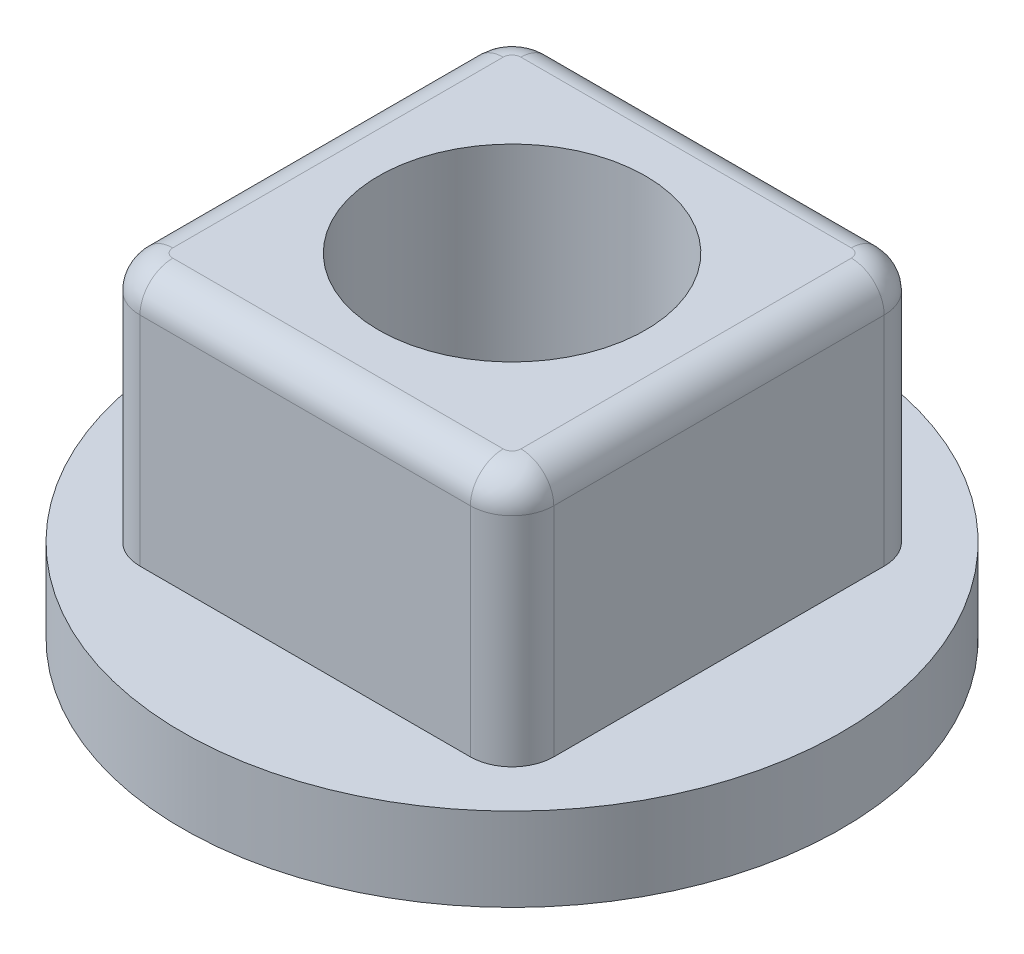
ISO-10303-21;
HEADER;
FILE_DESCRIPTION(('STEP AP214'),'2;1');
FILE_NAME('part.step','',(''),(''),'','','');
FILE_SCHEMA(('AUTOMOTIVE_DESIGN { 1 0 10303 214 1 1 1 1 }'));
ENDSEC;
DATA;
#1=APPLICATION_CONTEXT('core data for automotive mechanical design processes');
#2=APPLICATION_PROTOCOL_DEFINITION('international standard','automotive_design',2000,#1);
#3=PRODUCT_CONTEXT('',#1,'mechanical');
#4=PRODUCT('Part','Part','',(#3));
#5=PRODUCT_RELATED_PRODUCT_CATEGORY('part','',(#4));
#6=PRODUCT_DEFINITION_FORMATION('','',#4);
#7=PRODUCT_DEFINITION_CONTEXT('part definition',#1,'design');
#8=PRODUCT_DEFINITION('design','',#6,#7);
#9=PRODUCT_DEFINITION_SHAPE('','',#8);
#10=(LENGTH_UNIT() NAMED_UNIT(*) SI_UNIT(.MILLI.,.METRE.));
#11=(NAMED_UNIT(*) PLANE_ANGLE_UNIT() SI_UNIT($,.RADIAN.));
#12=(NAMED_UNIT(*) SI_UNIT($,.STERADIAN.) SOLID_ANGLE_UNIT());
#13=UNCERTAINTY_MEASURE_WITH_UNIT(LENGTH_MEASURE(1.E-05),#10,'distance_accuracy_value','');
#14=(GEOMETRIC_REPRESENTATION_CONTEXT(3) GLOBAL_UNCERTAINTY_ASSIGNED_CONTEXT((#13)) GLOBAL_UNIT_ASSIGNED_CONTEXT((#10,
#11,#12)) REPRESENTATION_CONTEXT('',''));
#15=CARTESIAN_POINT('',(0.,0.,0.));
#16=DIRECTION('',(0.,0.,1.));
#17=DIRECTION('',(1.,0.,0.));
#18=AXIS2_PLACEMENT_3D('',#15,#16,#17);
#19=CARTESIAN_POINT('',(-2.5146,5.08,2.5146));
#20=DIRECTION('',(0.,-1.,0.));
#21=DIRECTION('',(0.,0.,-1.));
#22=AXIS2_PLACEMENT_3D('',#19,#20,#21);
#23=CYLINDRICAL_SURFACE('',#22,0.635);
#24=DIRECTION('',(0.,1.,0.));
#25=VECTOR('',#24,1.);
#26=CARTESIAN_POINT('',(-3.1496,5.08,2.51459999999995));
#27=LINE('',#26,#25);
#28=CARTESIAN_POINT('',(-3.14960000000036,4.58,2.51460000000302));
#29=VERTEX_POINT('',#28);
#30=CARTESIAN_POINT('',(-3.1496,1.27,2.51459999999997));
#31=VERTEX_POINT('',#30);
#32=EDGE_CURVE('E69',#29,#31,#27,.F.);
#33=ORIENTED_EDGE('',*,*,#32,.T.);
#34=CARTESIAN_POINT('',(-2.5146,1.27,2.5146));
#35=DIRECTION('',(0.,-1.,0.));
#36=DIRECTION('',(0.,0.,-1.));
#37=AXIS2_PLACEMENT_3D('',#34,#35,#36);
#38=CIRCLE('',#37,0.635);
#39=CARTESIAN_POINT('',(-2.5146,1.27,3.1496));
#40=VERTEX_POINT('',#39);
#41=EDGE_CURVE('E21',#31,#40,#38,.F.);
#42=ORIENTED_EDGE('',*,*,#41,.T.);
#43=DIRECTION('',(0.,1.,0.));
#44=VECTOR('',#43,1.);
#45=CARTESIAN_POINT('',(-2.5146,5.08,3.1496));
#46=LINE('',#45,#44);
#47=CARTESIAN_POINT('',(-2.5146,4.58,3.14959999999967));
#48=VERTEX_POINT('',#47);
#49=EDGE_CURVE('E66',#40,#48,#46,.T.);
#50=ORIENTED_EDGE('',*,*,#49,.T.);
#51=CARTESIAN_POINT('',(-2.51460000000003,4.58000000000001,2.51459999999865));
#52=DIRECTION('',(0.,-1.,0.));
#53=DIRECTION('',(0.,0.,-1.));
#54=AXIS2_PLACEMENT_3D('',#51,#52,#53);
#55=CIRCLE('',#54,0.635000000000685);
#56=EDGE_CURVE('E232',#29,#48,#55,.F.);
#57=ORIENTED_EDGE('',*,*,#56,.F.);
#58=EDGE_LOOP('',(#33,#42,#50,#57));
#59=FACE_BOUND('',#58,.T.);
#60=ADVANCED_FACE('F18',(#59),#23,.T.);
#61=CARTESIAN_POINT('',(-2.5146,5.08,-2.5146));
#62=DIRECTION('',(0.,-1.,0.));
#63=DIRECTION('',(0.,0.,-1.));
#64=AXIS2_PLACEMENT_3D('',#61,#62,#63);
#65=CYLINDRICAL_SURFACE('',#64,0.635);
#66=DIRECTION('',(0.,1.,0.));
#67=VECTOR('',#66,1.);
#68=CARTESIAN_POINT('',(-2.51459999999995,5.08,-3.1496));
#69=LINE('',#68,#67);
#70=CARTESIAN_POINT('',(-2.51460000000237,4.58000000000076,-3.1496));
#71=VERTEX_POINT('',#70);
#72=CARTESIAN_POINT('',(-2.51459999999997,1.27,-3.1496));
#73=VERTEX_POINT('',#72);
#74=EDGE_CURVE('E188',#71,#73,#69,.F.);
#75=ORIENTED_EDGE('',*,*,#74,.T.);
#76=CARTESIAN_POINT('',(-2.5146,1.27,-2.5146));
#77=DIRECTION('',(0.,-1.,0.));
#78=DIRECTION('',(0.,0.,-1.));
#79=AXIS2_PLACEMENT_3D('',#76,#77,#78);
#80=CIRCLE('',#79,0.635);
#81=CARTESIAN_POINT('',(-3.1496,1.27,-2.5146));
#82=VERTEX_POINT('',#81);
#83=EDGE_CURVE('E71',#73,#82,#80,.F.);
#84=ORIENTED_EDGE('',*,*,#83,.T.);
#85=DIRECTION('',(0.,1.,0.));
#86=VECTOR('',#85,1.);
#87=CARTESIAN_POINT('',(-3.1496,5.08,-2.5146));
#88=LINE('',#87,#86);
#89=CARTESIAN_POINT('',(-3.14959999999983,4.58,-2.5146));
#90=VERTEX_POINT('',#89);
#91=EDGE_CURVE('E201',#82,#90,#88,.T.);
#92=ORIENTED_EDGE('',*,*,#91,.T.);
#93=CARTESIAN_POINT('',(-2.51459999999865,4.58000000000001,-2.51460000000003));
#94=DIRECTION('',(0.,-1.,0.));
#95=DIRECTION('',(1.,0.,0.));
#96=AXIS2_PLACEMENT_3D('',#93,#94,#95);
#97=CIRCLE('',#96,0.635000000000685);
#98=EDGE_CURVE('E242',#71,#90,#97,.F.);
#99=ORIENTED_EDGE('',*,*,#98,.F.);
#100=EDGE_LOOP('',(#75,#84,#92,#99));
#101=FACE_BOUND('',#100,.T.);
#102=ADVANCED_FACE('F369',(#101),#65,.T.);
#103=CARTESIAN_POINT('',(2.5146,5.08,2.5146));
#104=DIRECTION('',(0.,-1.,0.));
#105=DIRECTION('',(0.,0.,-1.));
#106=AXIS2_PLACEMENT_3D('',#103,#104,#105);
#107=CYLINDRICAL_SURFACE('',#106,0.635);
#108=DIRECTION('',(0.,1.,0.));
#109=VECTOR('',#108,1.);
#110=CARTESIAN_POINT('',(2.51459999999995,5.08,3.1496));
#111=LINE('',#110,#109);
#112=CARTESIAN_POINT('',(2.51460000000302,4.58,3.14960000000036));
#113=VERTEX_POINT('',#112);
#114=CARTESIAN_POINT('',(2.51459999999997,1.27,3.1496));
#115=VERTEX_POINT('',#114);
#116=EDGE_CURVE('E204',#113,#115,#111,.F.);
#117=ORIENTED_EDGE('',*,*,#116,.T.);
#118=CARTESIAN_POINT('',(2.5146,1.27,2.5146));
#119=DIRECTION('',(0.,-1.,0.));
#120=DIRECTION('',(0.,0.,-1.));
#121=AXIS2_PLACEMENT_3D('',#118,#119,#120);
#122=CIRCLE('',#121,0.635);
#123=CARTESIAN_POINT('',(3.1496,1.27,2.5146));
#124=VERTEX_POINT('',#123);
#125=EDGE_CURVE('E83',#115,#124,#122,.F.);
#126=ORIENTED_EDGE('',*,*,#125,.T.);
#127=DIRECTION('',(0.,1.,0.));
#128=VECTOR('',#127,1.);
#129=CARTESIAN_POINT('',(3.1496,5.08,2.5146));
#130=LINE('',#129,#128);
#131=CARTESIAN_POINT('',(3.14959999999983,4.58,2.51460000000015));
#132=VERTEX_POINT('',#131);
#133=EDGE_CURVE('E185',#124,#132,#130,.T.);
#134=ORIENTED_EDGE('',*,*,#133,.T.);
#135=CARTESIAN_POINT('',(2.51459999999865,4.58000000000001,2.51460000000003));
#136=DIRECTION('',(0.,-1.,0.));
#137=DIRECTION('',(1.,0.,0.));
#138=AXIS2_PLACEMENT_3D('',#135,#136,#137);
#139=CIRCLE('',#138,0.635000000000685);
#140=EDGE_CURVE('E301',#113,#132,#139,.F.);
#141=ORIENTED_EDGE('',*,*,#140,.F.);
#142=EDGE_LOOP('',(#117,#126,#134,#141));
#143=FACE_BOUND('',#142,.T.);
#144=ADVANCED_FACE('F400',(#143),#107,.T.);
#145=CARTESIAN_POINT('',(2.5146,5.08,-2.5146));
#146=DIRECTION('',(0.,-1.,0.));
#147=DIRECTION('',(0.,0.,-1.));
#148=AXIS2_PLACEMENT_3D('',#145,#146,#147);
#149=CYLINDRICAL_SURFACE('',#148,0.635);
#150=DIRECTION('',(0.,1.,0.));
#151=VECTOR('',#150,1.);
#152=CARTESIAN_POINT('',(3.1496,5.08,-2.51459999999997));
#153=LINE('',#152,#151);
#154=CARTESIAN_POINT('',(3.14960000000036,4.58,-2.51460000000303));
#155=VERTEX_POINT('',#154);
#156=CARTESIAN_POINT('',(3.1496,1.27,-2.51459999999999));
#157=VERTEX_POINT('',#156);
#158=EDGE_CURVE('E172',#155,#157,#153,.F.);
#159=ORIENTED_EDGE('',*,*,#158,.T.);
#160=CARTESIAN_POINT('',(2.5146,1.27,-2.5146));
#161=DIRECTION('',(0.,-1.,0.));
#162=DIRECTION('',(0.,0.,-1.));
#163=AXIS2_PLACEMENT_3D('',#160,#161,#162);
#164=CIRCLE('',#163,0.635);
#165=CARTESIAN_POINT('',(2.5146,1.27,-3.1496));
#166=VERTEX_POINT('',#165);
#167=EDGE_CURVE('E36',#157,#166,#164,.F.);
#168=ORIENTED_EDGE('',*,*,#167,.T.);
#169=DIRECTION('',(0.,1.,0.));
#170=VECTOR('',#169,1.);
#171=CARTESIAN_POINT('',(2.5146,5.08,-3.1496));
#172=LINE('',#171,#170);
#173=CARTESIAN_POINT('',(2.51460000000001,4.58,-3.14959999999983));
#174=VERTEX_POINT('',#173);
#175=EDGE_CURVE('E191',#166,#174,#172,.T.);
#176=ORIENTED_EDGE('',*,*,#175,.T.);
#177=CARTESIAN_POINT('',(2.51460000000003,4.58000000000001,-2.51459999999865));
#178=DIRECTION('',(0.,-1.,0.));
#179=DIRECTION('',(0.,0.,-1.));
#180=AXIS2_PLACEMENT_3D('',#177,#178,#179);
#181=CIRCLE('',#180,0.635000000000685);
#182=EDGE_CURVE('E271',#155,#174,#181,.F.);
#183=ORIENTED_EDGE('',*,*,#182,.F.);
#184=EDGE_LOOP('',(#159,#168,#176,#183));
#185=FACE_BOUND('',#184,.T.);
#186=ADVANCED_FACE('F413',(#185),#149,.T.);
#187=CARTESIAN_POINT('',(2.538898108304,4.58,2.6496));
#188=DIRECTION('',(-1.,0.,0.));
#189=DIRECTION('',(0.,0.,1.));
#190=AXIS2_PLACEMENT_3D('',#187,#188,#189);
#191=CYLINDRICAL_SURFACE('',#190,0.5);
#192=CARTESIAN_POINT('',(2.51460000000023,4.58000000000151,2.64960000000213));
#193=DIRECTION('',(-1.,0.,1.17253486400112E-11));
#194=DIRECTION('',(1.17253486400112E-11,0.,1.));
#195=AXIS2_PLACEMENT_3D('',#192,#193,#194);
#196=CIRCLE('',#195,0.499999999998586);
#197=CARTESIAN_POINT('',(2.51460000000024,5.08000000000005,2.64959999798593));
#198=VERTEX_POINT('',#197);
#199=EDGE_CURVE('E171',#198,#113,#196,.F.);
#200=ORIENTED_EDGE('',*,*,#199,.F.);
#201=DIRECTION('',(1.,0.,0.));
#202=VECTOR('',#201,1.);
#203=CARTESIAN_POINT('',(-3.1496,5.08,2.6496));
#204=LINE('',#203,#202);
#205=CARTESIAN_POINT('',(-2.51460000000002,5.08000000000005,2.64960000000019));
#206=VERTEX_POINT('',#205);
#207=EDGE_CURVE('E158',#206,#198,#204,.T.);
#208=ORIENTED_EDGE('',*,*,#207,.F.);
#209=CARTESIAN_POINT('',(-2.51460000000002,4.58000000000152,2.64960000000074));
#210=DIRECTION('',(-1.,0.,0.));
#211=DIRECTION('',(0.,0.,1.));
#212=AXIS2_PLACEMENT_3D('',#209,#210,#211);
#213=CIRCLE('',#212,0.499999999998586);
#214=EDGE_CURVE('E80',#48,#206,#213,.T.);
#215=ORIENTED_EDGE('',*,*,#214,.F.);
#216=DIRECTION('',(-1.,0.,0.));
#217=VECTOR('',#216,1.);
#218=CARTESIAN_POINT('',(-3.1496,4.58,3.1496));
#219=LINE('',#218,#217);
#220=EDGE_CURVE('E78',#48,#113,#219,.F.);
#221=ORIENTED_EDGE('',*,*,#220,.T.);
#222=EDGE_LOOP('',(#200,#208,#215,#221));
#223=FACE_BOUND('',#222,.T.);
#224=ADVANCED_FACE('F169',(#223),#191,.T.);
#225=CARTESIAN_POINT('',(2.64960000000074,4.58000000000151,2.51460000000003));
#226=DIRECTION('',(0.,0.,1.));
#227=DIRECTION('',(1.,0.,0.));
#228=AXIS2_PLACEMENT_3D('',#225,#226,#227);
#229=CIRCLE('',#228,0.499999999998586);
#230=TRIMMED_CURVE('',#229,(PARAMETER_VALUE(-1.84418935826752)),
(PARAMETER_VALUE(1.84418935826752)),.T.,.PARAMETER.);
#231=CARTESIAN_POINT('',(2.51459999999865,4.58000000000152,2.51460000000003));
#232=DIRECTION('',(0.,-1.,0.));
#233=AXIS1_PLACEMENT('',#231,#232);
#234=SURFACE_OF_REVOLUTION('',#230,#233);
#235=CARTESIAN_POINT('',(2.6496,4.58,2.51460000000056));
#236=DIRECTION('',(0.,0.,1.));
#237=DIRECTION('',(1.,0.,0.));
#238=AXIS2_PLACEMENT_3D('',#235,#236,#237);
#239=CIRCLE('',#238,0.5);
#240=CARTESIAN_POINT('',(2.64959999764931,5.08000000000002,2.51460000000043));
#241=VERTEX_POINT('',#240);
#242=EDGE_CURVE('E296',#241,#132,#239,.F.);
#243=ORIENTED_EDGE('',*,*,#242,.F.);
#244=CARTESIAN_POINT('',(2.51459999999865,5.0800000000001,2.51460000000004));
#245=DIRECTION('',(0.,-1.,0.));
#246=DIRECTION('',(1.,0.,0.));
#247=AXIS2_PLACEMENT_3D('',#244,#245,#246);
#248=CIRCLE('',#247,0.134999998658406);
#249=EDGE_CURVE('E101',#198,#241,#248,.F.);
#250=ORIENTED_EDGE('',*,*,#249,.F.);
#251=ORIENTED_EDGE('',*,*,#199,.T.);
#252=ORIENTED_EDGE('',*,*,#140,.T.);
#253=EDGE_LOOP('',(#243,#250,#251,#252));
#254=FACE_BOUND('',#253,.T.);
#255=ADVANCED_FACE('F307',(#254),#234,.F.);
#256=CARTESIAN_POINT('',(2.6496,4.58,-2.538898108304));
#257=DIRECTION('',(0.,0.,1.));
#258=DIRECTION('',(1.,0.,0.));
#259=AXIS2_PLACEMENT_3D('',#256,#257,#258);
#260=CYLINDRICAL_SURFACE('',#259,0.5);
#261=CARTESIAN_POINT('',(2.64960000000213,4.58000000000151,-2.51460000000023));
#262=DIRECTION('',(1.17253486400112E-11,0.,1.));
#263=DIRECTION('',(1.,0.,-1.17253486400112E-11));
#264=AXIS2_PLACEMENT_3D('',#261,#262,#263);
#265=CIRCLE('',#264,0.499999999998586);
#266=CARTESIAN_POINT('',(2.64959999865759,5.08000000000005,-2.51460000000024));
#267=VERTEX_POINT('',#266);
#268=EDGE_CURVE('E288',#267,#155,#265,.F.);
#269=ORIENTED_EDGE('',*,*,#268,.F.);
#270=DIRECTION('',(0.,0.,1.));
#271=VECTOR('',#270,1.);
#272=CARTESIAN_POINT('',(2.64959999731337,5.08,3.1496));
#273=LINE('',#272,#271);
#274=EDGE_CURVE('E174',#241,#267,#273,.F.);
#275=ORIENTED_EDGE('',*,*,#274,.F.);
#276=ORIENTED_EDGE('',*,*,#242,.T.);
#277=DIRECTION('',(0.,0.,1.));
#278=VECTOR('',#277,1.);
#279=CARTESIAN_POINT('',(3.1496,4.58,-3.1496));
#280=LINE('',#279,#278);
#281=EDGE_CURVE('E175',#132,#155,#280,.F.);
#282=ORIENTED_EDGE('',*,*,#281,.T.);
#283=EDGE_LOOP('',(#269,#275,#276,#282));
#284=FACE_BOUND('',#283,.T.);
#285=ADVANCED_FACE('F282',(#284),#260,.T.);
#286=CARTESIAN_POINT('',(2.51460000000003,4.58000000000151,-2.64960000000074));
#287=DIRECTION('',(1.,0.,0.));
#288=DIRECTION('',(0.,0.,-1.));
#289=AXIS2_PLACEMENT_3D('',#286,#287,#288);
#290=CIRCLE('',#289,0.499999999998586);
#291=TRIMMED_CURVE('',#290,(PARAMETER_VALUE(-1.84418935826752)),
(PARAMETER_VALUE(1.84418935826752)),.T.,.PARAMETER.);
#292=CARTESIAN_POINT('',(2.51460000000003,4.58000000000152,-2.51459999999865));
#293=DIRECTION('',(0.,-1.,0.));
#294=AXIS1_PLACEMENT('',#292,#293);
#295=SURFACE_OF_REVOLUTION('',#291,#294);
#296=CARTESIAN_POINT('',(2.5146,4.58,-2.6496));
#297=DIRECTION('',(1.,0.,0.));
#298=DIRECTION('',(0.,0.,-1.));
#299=AXIS2_PLACEMENT_3D('',#296,#297,#298);
#300=CIRCLE('',#299,0.5);
#301=CARTESIAN_POINT('',(2.51460000000001,5.08000000000002,-2.64959999932845));
#302=VERTEX_POINT('',#301);
#303=EDGE_CURVE('E266',#302,#174,#300,.F.);
#304=ORIENTED_EDGE('',*,*,#303,.F.);
#305=CARTESIAN_POINT('',(2.51460000000004,5.0800000000001,-2.51459999999865));
#306=DIRECTION('',(0.,-1.,0.));
#307=DIRECTION('',(0.,0.,-1.));
#308=AXIS2_PLACEMENT_3D('',#305,#306,#307);
#309=CIRCLE('',#308,0.135000000001723);
#310=EDGE_CURVE('E420',#267,#302,#309,.F.);
#311=ORIENTED_EDGE('',*,*,#310,.F.);
#312=ORIENTED_EDGE('',*,*,#268,.T.);
#313=ORIENTED_EDGE('',*,*,#182,.T.);
#314=EDGE_LOOP('',(#304,#311,#312,#313));
#315=FACE_BOUND('',#314,.T.);
#316=ADVANCED_FACE('F278',(#315),#295,.F.);
#317=CARTESIAN_POINT('',(-2.538898108304,4.58,-2.6496));
#318=DIRECTION('',(1.,0.,0.));
#319=DIRECTION('',(0.,0.,-1.));
#320=AXIS2_PLACEMENT_3D('',#317,#318,#319);
#321=CYLINDRICAL_SURFACE('',#320,0.5);
#322=CARTESIAN_POINT('',(-2.51460000000023,4.58000000000152,-2.64960000000213));
#323=DIRECTION('',(1.,0.,-1.17259151939009E-11));
#324=DIRECTION('',(-1.17259151939009E-11,0.,-1.));
#325=AXIS2_PLACEMENT_3D('',#322,#323,#324);
#326=CIRCLE('',#325,0.499999999998586);
#327=CARTESIAN_POINT('',(-2.51460000000024,5.08000000000005,-2.64959999865759));
#328=VERTEX_POINT('',#327);
#329=EDGE_CURVE('E258',#328,#71,#326,.F.);
#330=ORIENTED_EDGE('',*,*,#329,.F.);
#331=DIRECTION('',(1.,0.,0.));
#332=VECTOR('',#331,1.);
#333=CARTESIAN_POINT('',(-3.1496,5.08,-2.6496));
#334=LINE('',#333,#332);
#335=EDGE_CURVE('E419',#302,#328,#334,.F.);
#336=ORIENTED_EDGE('',*,*,#335,.F.);
#337=ORIENTED_EDGE('',*,*,#303,.T.);
#338=DIRECTION('',(1.,0.,0.));
#339=VECTOR('',#338,1.);
#340=CARTESIAN_POINT('',(-3.1496,4.58,-3.1496));
#341=LINE('',#340,#339);
#342=EDGE_CURVE('E194',#174,#71,#341,.F.);
#343=ORIENTED_EDGE('',*,*,#342,.T.);
#344=EDGE_LOOP('',(#330,#336,#337,#343));
#345=FACE_BOUND('',#344,.T.);
#346=ADVANCED_FACE('F252',(#345),#321,.T.);
#347=CARTESIAN_POINT('',(-2.37959999999655,4.58000000000152,-2.51460000000003));
#348=DIRECTION('',(0.,0.,1.));
#349=DIRECTION('',(1.,0.,0.));
#350=AXIS2_PLACEMENT_3D('',#347,#348,#349);
#351=CIRCLE('',#350,0.499999999998586);
#352=TRIMMED_CURVE('',#351,(PARAMETER_VALUE(-1.84418935826752)),
(PARAMETER_VALUE(1.84418935826752)),.T.,.PARAMETER.);
#353=CARTESIAN_POINT('',(-2.51459999999865,4.58000000000152,-2.51460000000003));
#354=DIRECTION('',(0.,-1.,0.));
#355=AXIS1_PLACEMENT('',#353,#354);
#356=SURFACE_OF_REVOLUTION('',#352,#355);
#357=CARTESIAN_POINT('',(-2.6496,4.58,-2.5146));
#358=DIRECTION('',(0.,0.,-1.));
#359=DIRECTION('',(-1.,0.,0.));
#360=AXIS2_PLACEMENT_3D('',#357,#358,#359);
#361=CIRCLE('',#360,0.5);
#362=CARTESIAN_POINT('',(-2.64959999932845,5.08000000000002,-2.51460000000001));
#363=VERTEX_POINT('',#362);
#364=EDGE_CURVE('E237',#363,#90,#361,.F.);
#365=ORIENTED_EDGE('',*,*,#364,.F.);
#366=CARTESIAN_POINT('',(-2.51459999999865,5.0800000000001,-2.51460000000004));
#367=DIRECTION('',(0.,-1.,0.));
#368=DIRECTION('',(-1.,0.,0.));
#369=AXIS2_PLACEMENT_3D('',#366,#367,#368);
#370=CIRCLE('',#369,0.135000000001722);
#371=EDGE_CURVE('E144',#328,#363,#370,.F.);
#372=ORIENTED_EDGE('',*,*,#371,.F.);
#373=ORIENTED_EDGE('',*,*,#329,.T.);
#374=ORIENTED_EDGE('',*,*,#98,.T.);
#375=EDGE_LOOP('',(#365,#372,#373,#374));
#376=FACE_BOUND('',#375,.T.);
#377=ADVANCED_FACE('F248',(#376),#356,.F.);
#378=CARTESIAN_POINT('',(-2.6496,4.58,2.538898108304));
#379=DIRECTION('',(0.,0.,-1.));
#380=DIRECTION('',(-1.,0.,0.));
#381=AXIS2_PLACEMENT_3D('',#378,#379,#380);
#382=CYLINDRICAL_SURFACE('',#381,0.5);
#383=CARTESIAN_POINT('',(-2.64960000000213,4.58000000000152,2.51460000000023));
#384=DIRECTION('',(-1.17259151939009E-11,0.,-1.));
#385=DIRECTION('',(-1.,0.,1.17259151939009E-11));
#386=AXIS2_PLACEMENT_3D('',#383,#384,#385);
#387=CIRCLE('',#386,0.499999999998586);
#388=CARTESIAN_POINT('',(-2.64959999865759,5.08000000000005,2.51460000000024));
#389=VERTEX_POINT('',#388);
#390=EDGE_CURVE('E235',#389,#29,#387,.F.);
#391=ORIENTED_EDGE('',*,*,#390,.F.);
#392=DIRECTION('',(0.,0.,1.));
#393=VECTOR('',#392,1.);
#394=CARTESIAN_POINT('',(-2.6496,5.08,3.1496));
#395=LINE('',#394,#393);
#396=EDGE_CURVE('E91',#363,#389,#395,.T.);
#397=ORIENTED_EDGE('',*,*,#396,.F.);
#398=ORIENTED_EDGE('',*,*,#364,.T.);
#399=DIRECTION('',(0.,0.,-1.));
#400=VECTOR('',#399,1.);
#401=CARTESIAN_POINT('',(-3.1496,4.58,-3.1496));
#402=LINE('',#401,#400);
#403=EDGE_CURVE('E198',#90,#29,#402,.F.);
#404=ORIENTED_EDGE('',*,*,#403,.T.);
#405=EDGE_LOOP('',(#391,#397,#398,#404));
#406=FACE_BOUND('',#405,.T.);
#407=ADVANCED_FACE('F220',(#406),#382,.T.);
#408=CARTESIAN_POINT('',(-2.51460000000003,4.58000000000152,2.37959999999655));
#409=DIRECTION('',(1.,0.,0.));
#410=DIRECTION('',(0.,0.,-1.));
#411=AXIS2_PLACEMENT_3D('',#408,#409,#410);
#412=CIRCLE('',#411,0.499999999998586);
#413=TRIMMED_CURVE('',#412,(PARAMETER_VALUE(-1.84418935826752)),
(PARAMETER_VALUE(1.84418935826752)),.T.,.PARAMETER.);
#414=CARTESIAN_POINT('',(-2.51460000000003,4.58000000000152,2.51459999999865));
#415=DIRECTION('',(0.,-1.,0.));
#416=AXIS1_PLACEMENT('',#414,#415);
#417=SURFACE_OF_REVOLUTION('',#413,#416);
#418=ORIENTED_EDGE('',*,*,#214,.T.);
#419=CARTESIAN_POINT('',(-2.51460000000004,5.0800000000001,2.51459999999865));
#420=DIRECTION('',(0.,-1.,0.));
#421=DIRECTION('',(0.,0.,1.));
#422=AXIS2_PLACEMENT_3D('',#419,#420,#421);
#423=CIRCLE('',#422,0.135000000001722);
#424=EDGE_CURVE('E86',#389,#206,#423,.F.);
#425=ORIENTED_EDGE('',*,*,#424,.F.);
#426=ORIENTED_EDGE('',*,*,#390,.T.);
#427=ORIENTED_EDGE('',*,*,#56,.T.);
#428=EDGE_LOOP('',(#418,#425,#426,#427));
#429=FACE_BOUND('',#428,.T.);
#430=ADVANCED_FACE('F215',(#429),#417,.F.);
#431=CARTESIAN_POINT('',(-3.1496,5.08,3.1496));
#432=DIRECTION('',(0.,0.,-1.));
#433=DIRECTION('',(-1.,0.,0.));
#434=AXIS2_PLACEMENT_3D('',#431,#432,#433);
#435=PLANE('',#434);
#436=ORIENTED_EDGE('',*,*,#116,.F.);
#437=ORIENTED_EDGE('',*,*,#220,.F.);
#438=ORIENTED_EDGE('',*,*,#49,.F.);
#439=DIRECTION('',(1.,0.,0.));
#440=VECTOR('',#439,1.);
#441=CARTESIAN_POINT('',(0.,1.27,3.1496));
#442=LINE('',#441,#440);
#443=EDGE_CURVE('E76',#115,#40,#442,.F.);
#444=ORIENTED_EDGE('',*,*,#443,.F.);
#445=EDGE_LOOP('',(#436,#437,#438,#444));
#446=FACE_BOUND('',#445,.T.);
#447=ADVANCED_FACE('F75',(#446),#435,.F.);
#448=CARTESIAN_POINT('',(-3.1496,5.08,-3.1496));
#449=DIRECTION('',(1.,0.,0.));
#450=DIRECTION('',(0.,0.,-1.));
#451=AXIS2_PLACEMENT_3D('',#448,#449,#450);
#452=PLANE('',#451);
#453=ORIENTED_EDGE('',*,*,#32,.F.);
#454=ORIENTED_EDGE('',*,*,#403,.F.);
#455=ORIENTED_EDGE('',*,*,#91,.F.);
#456=DIRECTION('',(0.,0.,1.));
#457=VECTOR('',#456,1.);
#458=CARTESIAN_POINT('',(-3.1496,1.27,0.));
#459=LINE('',#458,#457);
#460=EDGE_CURVE('E85',#31,#82,#459,.F.);
#461=ORIENTED_EDGE('',*,*,#460,.F.);
#462=EDGE_LOOP('',(#453,#454,#455,#461));
#463=FACE_BOUND('',#462,.T.);
#464=ADVANCED_FACE('F376',(#463),#452,.F.);
#465=CARTESIAN_POINT('',(-3.1496,5.08,-3.1496));
#466=DIRECTION('',(0.,0.,1.));
#467=DIRECTION('',(1.,0.,0.));
#468=AXIS2_PLACEMENT_3D('',#465,#466,#467);
#469=PLANE('',#468);
#470=ORIENTED_EDGE('',*,*,#74,.F.);
#471=ORIENTED_EDGE('',*,*,#342,.F.);
#472=ORIENTED_EDGE('',*,*,#175,.F.);
#473=DIRECTION('',(1.,0.,0.));
#474=VECTOR('',#473,1.);
#475=CARTESIAN_POINT('',(0.,1.27,-3.1496));
#476=LINE('',#475,#474);
#477=EDGE_CURVE('E88',#73,#166,#476,.T.);
#478=ORIENTED_EDGE('',*,*,#477,.F.);
#479=EDGE_LOOP('',(#470,#471,#472,#478));
#480=FACE_BOUND('',#479,.T.);
#481=ADVANCED_FACE('F409',(#480),#469,.F.);
#482=CARTESIAN_POINT('',(3.1496,5.08,-3.1496));
#483=DIRECTION('',(-1.,0.,0.));
#484=DIRECTION('',(0.,0.,1.));
#485=AXIS2_PLACEMENT_3D('',#482,#483,#484);
#486=PLANE('',#485);
#487=ORIENTED_EDGE('',*,*,#158,.F.);
#488=ORIENTED_EDGE('',*,*,#281,.F.);
#489=ORIENTED_EDGE('',*,*,#133,.F.);
#490=DIRECTION('',(0.,0.,1.));
#491=VECTOR('',#490,1.);
#492=CARTESIAN_POINT('',(3.1496,1.27,0.));
#493=LINE('',#492,#491);
#494=EDGE_CURVE('E363',#157,#124,#493,.T.);
#495=ORIENTED_EDGE('',*,*,#494,.F.);
#496=EDGE_LOOP('',(#487,#488,#489,#495));
#497=FACE_BOUND('',#496,.T.);
#498=ADVANCED_FACE('F119',(#497),#486,.F.);
#499=CARTESIAN_POINT('',(-3.1496,5.08,3.1496));
#500=DIRECTION('',(0.,1.,0.));
#501=DIRECTION('',(0.,0.,1.));
#502=AXIS2_PLACEMENT_3D('',#499,#500,#501);
#503=PLANE('',#502);
#504=ORIENTED_EDGE('',*,*,#396,.T.);
#505=ORIENTED_EDGE('',*,*,#424,.T.);
#506=ORIENTED_EDGE('',*,*,#207,.T.);
#507=ORIENTED_EDGE('',*,*,#249,.T.);
#508=ORIENTED_EDGE('',*,*,#274,.T.);
#509=ORIENTED_EDGE('',*,*,#310,.T.);
#510=ORIENTED_EDGE('',*,*,#335,.T.);
#511=ORIENTED_EDGE('',*,*,#371,.T.);
#512=EDGE_LOOP('',(#504,#505,#506,#507,#508,#509,#510,#511));
#513=FACE_BOUND('',#512,.T.);
#514=CARTESIAN_POINT('',(0.,5.08,0.));
#515=DIRECTION('',(0.,-1.,0.));
#516=DIRECTION('',(0.,0.,-1.));
#517=AXIS2_PLACEMENT_3D('',#514,#515,#516);
#518=CIRCLE('',#517,2.032);
#519=CARTESIAN_POINT('',(0.,5.08,-2.032));
#520=VERTEX_POINT('',#519);
#521=EDGE_CURVE('E360',#520,#520,#518,.T.);
#522=ORIENTED_EDGE('',*,*,#521,.T.);
#523=EDGE_LOOP('',(#522));
#524=FACE_BOUND('',#523,.T.);
#525=ADVANCED_FACE('F109',(#513,#524),#503,.T.);
#526=CARTESIAN_POINT('',(0.,1.27,0.));
#527=DIRECTION('',(0.,1.,0.));
#528=DIRECTION('',(0.,0.,1.));
#529=AXIS2_PLACEMENT_3D('',#526,#527,#528);
#530=PLANE('',#529);
#531=CARTESIAN_POINT('',(0.,1.27,0.));
#532=DIRECTION('',(0.,-1.,0.));
#533=DIRECTION('',(0.,0.,-1.));
#534=AXIS2_PLACEMENT_3D('',#531,#532,#533);
#535=CIRCLE('',#534,5.0165);
#536=CARTESIAN_POINT('',(0.,1.27,-5.0165));
#537=VERTEX_POINT('',#536);
#538=EDGE_CURVE('E357',#537,#537,#535,.T.);
#539=ORIENTED_EDGE('',*,*,#538,.F.);
#540=EDGE_LOOP('',(#539));
#541=FACE_BOUND('',#540,.T.);
#542=ORIENTED_EDGE('',*,*,#167,.F.);
#543=ORIENTED_EDGE('',*,*,#494,.T.);
#544=ORIENTED_EDGE('',*,*,#125,.F.);
#545=ORIENTED_EDGE('',*,*,#443,.T.);
#546=ORIENTED_EDGE('',*,*,#41,.F.);
#547=ORIENTED_EDGE('',*,*,#460,.T.);
#548=ORIENTED_EDGE('',*,*,#83,.F.);
#549=ORIENTED_EDGE('',*,*,#477,.T.);
#550=EDGE_LOOP('',(#542,#543,#544,#545,#546,#547,#548,#549));
#551=FACE_BOUND('',#550,.T.);
#552=ADVANCED_FACE('F82',(#541,#551),#530,.T.);
#553=CARTESIAN_POINT('',(0.,0.,0.));
#554=DIRECTION('',(0.,-1.,0.));
#555=DIRECTION('',(0.,0.,-1.));
#556=AXIS2_PLACEMENT_3D('',#553,#554,#555);
#557=CYLINDRICAL_SURFACE('',#556,2.032);
#558=ORIENTED_EDGE('',*,*,#521,.F.);
#559=EDGE_LOOP('',(#558));
#560=FACE_BOUND('',#559,.T.);
#561=CARTESIAN_POINT('',(0.,0.,0.));
#562=DIRECTION('',(0.,-1.,0.));
#563=DIRECTION('',(0.,0.,-1.));
#564=AXIS2_PLACEMENT_3D('',#561,#562,#563);
#565=CIRCLE('',#564,2.032);
#566=CARTESIAN_POINT('',(0.,0.,-2.032));
#567=VERTEX_POINT('',#566);
#568=EDGE_CURVE('E27',#567,#567,#565,.T.);
#569=ORIENTED_EDGE('',*,*,#568,.T.);
#570=EDGE_LOOP('',(#569));
#571=FACE_BOUND('',#570,.T.);
#572=ADVANCED_FACE('F440',(#560,#571),#557,.F.);
#573=CARTESIAN_POINT('',(0.,1.27,0.));
#574=DIRECTION('',(0.,-1.,0.));
#575=DIRECTION('',(0.,0.,-1.));
#576=AXIS2_PLACEMENT_3D('',#573,#574,#575);
#577=CYLINDRICAL_SURFACE('',#576,5.0165);
#578=ORIENTED_EDGE('',*,*,#538,.T.);
#579=EDGE_LOOP('',(#578));
#580=FACE_BOUND('',#579,.T.);
#581=CARTESIAN_POINT('',(0.,0.,0.));
#582=DIRECTION('',(0.,-1.,0.));
#583=DIRECTION('',(0.,0.,-1.));
#584=AXIS2_PLACEMENT_3D('',#581,#582,#583);
#585=CIRCLE('',#584,5.0165);
#586=CARTESIAN_POINT('',(0.,0.,-5.0165));
#587=VERTEX_POINT('',#586);
#588=EDGE_CURVE('E11',#587,#587,#585,.F.);
#589=ORIENTED_EDGE('',*,*,#588,.T.);
#590=EDGE_LOOP('',(#589));
#591=FACE_BOUND('',#590,.T.);
#592=ADVANCED_FACE('F434',(#580,#591),#577,.T.);
#593=CARTESIAN_POINT('',(0.,0.,0.));
#594=DIRECTION('',(0.,1.,0.));
#595=DIRECTION('',(0.,0.,1.));
#596=AXIS2_PLACEMENT_3D('',#593,#594,#595);
#597=PLANE('',#596);
#598=ORIENTED_EDGE('',*,*,#588,.F.);
#599=EDGE_LOOP('',(#598));
#600=FACE_BOUND('',#599,.T.);
#601=ORIENTED_EDGE('',*,*,#568,.F.);
#602=EDGE_LOOP('',(#601));
#603=FACE_BOUND('',#602,.T.);
#604=ADVANCED_FACE('F432',(#600,#603),#597,.F.);
#605=CLOSED_SHELL('',(#60,#102,#144,#186,#224,#255,#285,#316,#346,#377,#407,#430,#447,#464,#481,
#498,#525,#552,#572,#592,#604));
#606=MANIFOLD_SOLID_BREP('B1',#605);
#607=ADVANCED_BREP_SHAPE_REPRESENTATION('',(#18,#606),#14);
#608=SHAPE_DEFINITION_REPRESENTATION(#9,#607);
ENDSEC;
END-ISO-10303-21;
